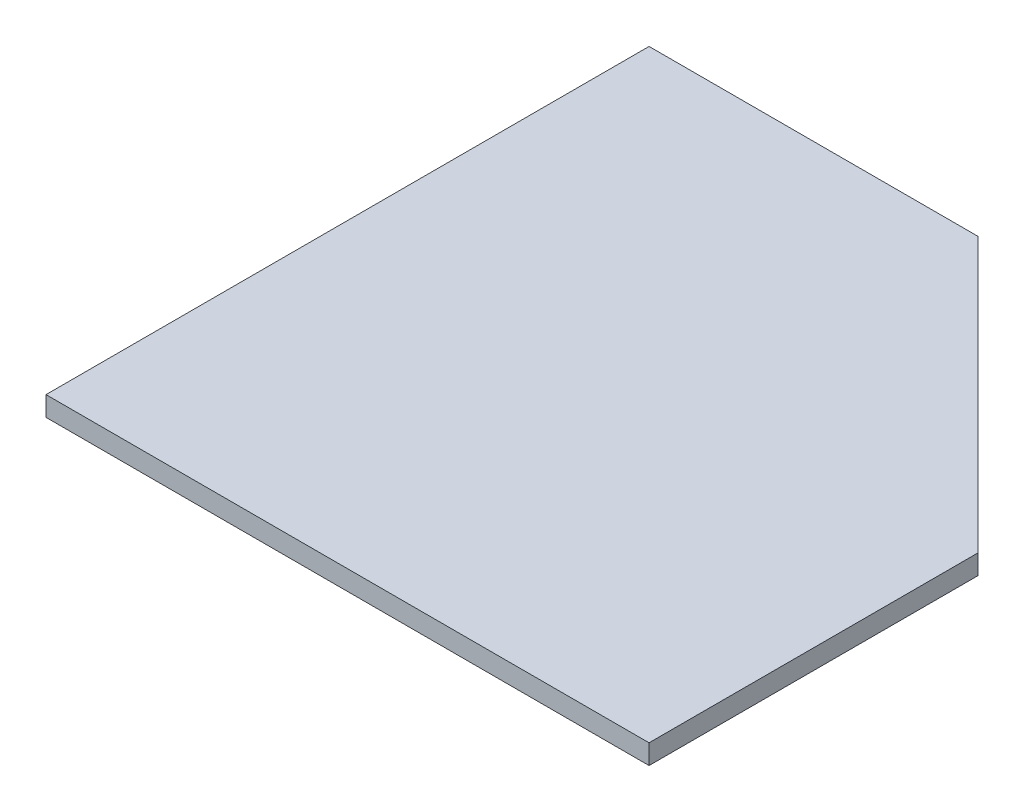
ISO-10303-21;
HEADER;
FILE_DESCRIPTION(('STEP AP214'),'2;1');
FILE_NAME('part.step','',(''),(''),'','','');
FILE_SCHEMA(('AUTOMOTIVE_DESIGN { 1 0 10303 214 1 1 1 1 }'));
ENDSEC;
DATA;
#1=APPLICATION_CONTEXT('core data for automotive mechanical design processes');
#2=APPLICATION_PROTOCOL_DEFINITION('international standard','automotive_design',2000,#1);
#3=PRODUCT_CONTEXT('',#1,'mechanical');
#4=PRODUCT('Part','Part','',(#3));
#5=PRODUCT_RELATED_PRODUCT_CATEGORY('part','',(#4));
#6=PRODUCT_DEFINITION_FORMATION('','',#4);
#7=PRODUCT_DEFINITION_CONTEXT('part definition',#1,'design');
#8=PRODUCT_DEFINITION('design','',#6,#7);
#9=PRODUCT_DEFINITION_SHAPE('','',#8);
#10=(LENGTH_UNIT() NAMED_UNIT(*) SI_UNIT(.MILLI.,.METRE.));
#11=(NAMED_UNIT(*) PLANE_ANGLE_UNIT() SI_UNIT($,.RADIAN.));
#12=(NAMED_UNIT(*) SI_UNIT($,.STERADIAN.) SOLID_ANGLE_UNIT());
#13=UNCERTAINTY_MEASURE_WITH_UNIT(LENGTH_MEASURE(1.E-05),#10,'distance_accuracy_value','');
#14=(GEOMETRIC_REPRESENTATION_CONTEXT(3) GLOBAL_UNCERTAINTY_ASSIGNED_CONTEXT((#13)) GLOBAL_UNIT_ASSIGNED_CONTEXT((#10,
#11,#12)) REPRESENTATION_CONTEXT('',''));
#15=CARTESIAN_POINT('',(0.,0.,0.));
#16=DIRECTION('',(0.,0.,1.));
#17=DIRECTION('',(1.,0.,0.));
#18=AXIS2_PLACEMENT_3D('',#15,#16,#17);
#19=CARTESIAN_POINT('',(550.,18.,0.));
#20=DIRECTION('',(0.,0.,-1.));
#21=DIRECTION('',(-1.,0.,0.));
#22=AXIS2_PLACEMENT_3D('',#19,#20,#21);
#23=PLANE('',#22);
#24=DIRECTION('',(1.,0.,0.));
#25=VECTOR('',#24,1.);
#26=CARTESIAN_POINT('',(550.,0.,0.));
#27=LINE('',#26,#25);
#28=CARTESIAN_POINT('',(0.,0.,0.));
#29=VERTEX_POINT('',#28);
#30=CARTESIAN_POINT('',(550.,0.,0.));
#31=VERTEX_POINT('',#30);
#32=EDGE_CURVE('E108',#29,#31,#27,.T.);
#33=ORIENTED_EDGE('',*,*,#32,.T.);
#34=DIRECTION('',(0.,-1.,0.));
#35=VECTOR('',#34,1.);
#36=CARTESIAN_POINT('',(550.,18.,0.));
#37=LINE('',#36,#35);
#38=CARTESIAN_POINT('',(550.,18.,0.));
#39=VERTEX_POINT('',#38);
#40=EDGE_CURVE('E11',#39,#31,#37,.T.);
#41=ORIENTED_EDGE('',*,*,#40,.F.);
#42=DIRECTION('',(1.,0.,0.));
#43=VECTOR('',#42,1.);
#44=CARTESIAN_POINT('',(550.,18.,0.));
#45=LINE('',#44,#43);
#46=CARTESIAN_POINT('',(0.,18.,0.));
#47=VERTEX_POINT('',#46);
#48=EDGE_CURVE('E116',#47,#39,#45,.T.);
#49=ORIENTED_EDGE('',*,*,#48,.F.);
#50=DIRECTION('',(0.,-1.,0.));
#51=VECTOR('',#50,1.);
#52=CARTESIAN_POINT('',(0.,18.,0.));
#53=LINE('',#52,#51);
#54=EDGE_CURVE('E104',#47,#29,#53,.T.);
#55=ORIENTED_EDGE('',*,*,#54,.T.);
#56=EDGE_LOOP('',(#33,#41,#49,#55));
#57=FACE_BOUND('',#56,.T.);
#58=ADVANCED_FACE('F34',(#57),#23,.F.);
#59=CARTESIAN_POINT('',(550.,18.,-300.));
#60=DIRECTION('',(-1.,0.,0.));
#61=DIRECTION('',(0.,0.,1.));
#62=AXIS2_PLACEMENT_3D('',#59,#60,#61);
#63=PLANE('',#62);
#64=DIRECTION('',(0.,0.,-1.));
#65=VECTOR('',#64,1.);
#66=CARTESIAN_POINT('',(550.,0.,-300.));
#67=LINE('',#66,#65);
#68=CARTESIAN_POINT('',(550.,0.,-300.));
#69=VERTEX_POINT('',#68);
#70=EDGE_CURVE('E111',#31,#69,#67,.T.);
#71=ORIENTED_EDGE('',*,*,#70,.T.);
#72=DIRECTION('',(0.,-1.,0.));
#73=VECTOR('',#72,1.);
#74=CARTESIAN_POINT('',(550.,18.,-300.));
#75=LINE('',#74,#73);
#76=CARTESIAN_POINT('',(550.,18.,-300.));
#77=VERTEX_POINT('',#76);
#78=EDGE_CURVE('E42',#77,#69,#75,.T.);
#79=ORIENTED_EDGE('',*,*,#78,.F.);
#80=DIRECTION('',(0.,0.,-1.));
#81=VECTOR('',#80,1.);
#82=CARTESIAN_POINT('',(550.,18.,-300.));
#83=LINE('',#82,#81);
#84=EDGE_CURVE('E84',#39,#77,#83,.T.);
#85=ORIENTED_EDGE('',*,*,#84,.F.);
#86=ORIENTED_EDGE('',*,*,#40,.T.);
#87=EDGE_LOOP('',(#71,#79,#85,#86));
#88=FACE_BOUND('',#87,.T.);
#89=ADVANCED_FACE('F135',(#88),#63,.F.);
#90=CARTESIAN_POINT('',(300.,18.,-550.));
#91=DIRECTION('',(-0.707106781186548,0.,0.707106781186547));
#92=DIRECTION('',(0.707106781186547,0.,0.707106781186548));
#93=AXIS2_PLACEMENT_3D('',#90,#91,#92);
#94=PLANE('',#93);
#95=DIRECTION('',(-0.707106781186547,0.,-0.707106781186548));
#96=VECTOR('',#95,1.);
#97=CARTESIAN_POINT('',(300.,0.,-550.));
#98=LINE('',#97,#96);
#99=CARTESIAN_POINT('',(300.,0.,-550.));
#100=VERTEX_POINT('',#99);
#101=EDGE_CURVE('E99',#69,#100,#98,.T.);
#102=ORIENTED_EDGE('',*,*,#101,.T.);
#103=DIRECTION('',(0.,-1.,0.));
#104=VECTOR('',#103,1.);
#105=CARTESIAN_POINT('',(300.,18.,-550.));
#106=LINE('',#105,#104);
#107=CARTESIAN_POINT('',(300.,18.,-550.));
#108=VERTEX_POINT('',#107);
#109=EDGE_CURVE('E96',#108,#100,#106,.T.);
#110=ORIENTED_EDGE('',*,*,#109,.F.);
#111=DIRECTION('',(-0.707106781186547,0.,-0.707106781186548));
#112=VECTOR('',#111,1.);
#113=CARTESIAN_POINT('',(300.,18.,-550.));
#114=LINE('',#113,#112);
#115=EDGE_CURVE('E88',#77,#108,#114,.T.);
#116=ORIENTED_EDGE('',*,*,#115,.F.);
#117=ORIENTED_EDGE('',*,*,#78,.T.);
#118=EDGE_LOOP('',(#102,#110,#116,#117));
#119=FACE_BOUND('',#118,.T.);
#120=ADVANCED_FACE('F97',(#119),#94,.F.);
#121=CARTESIAN_POINT('',(0.,18.,-550.));
#122=DIRECTION('',(0.,0.,1.));
#123=DIRECTION('',(1.,0.,0.));
#124=AXIS2_PLACEMENT_3D('',#121,#122,#123);
#125=PLANE('',#124);
#126=DIRECTION('',(-1.,0.,0.));
#127=VECTOR('',#126,1.);
#128=CARTESIAN_POINT('',(0.,0.,-550.));
#129=LINE('',#128,#127);
#130=CARTESIAN_POINT('',(0.,0.,-550.));
#131=VERTEX_POINT('',#130);
#132=EDGE_CURVE('E70',#100,#131,#129,.T.);
#133=ORIENTED_EDGE('',*,*,#132,.T.);
#134=DIRECTION('',(0.,-1.,0.));
#135=VECTOR('',#134,1.);
#136=CARTESIAN_POINT('',(0.,18.,-550.));
#137=LINE('',#136,#135);
#138=CARTESIAN_POINT('',(0.,18.,-550.));
#139=VERTEX_POINT('',#138);
#140=EDGE_CURVE('E100',#139,#131,#137,.T.);
#141=ORIENTED_EDGE('',*,*,#140,.F.);
#142=DIRECTION('',(-1.,0.,0.));
#143=VECTOR('',#142,1.);
#144=CARTESIAN_POINT('',(0.,18.,-550.));
#145=LINE('',#144,#143);
#146=EDGE_CURVE('E92',#108,#139,#145,.T.);
#147=ORIENTED_EDGE('',*,*,#146,.F.);
#148=ORIENTED_EDGE('',*,*,#109,.T.);
#149=EDGE_LOOP('',(#133,#141,#147,#148));
#150=FACE_BOUND('',#149,.T.);
#151=ADVANCED_FACE('F102',(#150),#125,.F.);
#152=CARTESIAN_POINT('',(0.,18.,0.));
#153=DIRECTION('',(1.,0.,0.));
#154=DIRECTION('',(0.,0.,-1.));
#155=AXIS2_PLACEMENT_3D('',#152,#153,#154);
#156=PLANE('',#155);
#157=DIRECTION('',(0.,0.,1.));
#158=VECTOR('',#157,1.);
#159=CARTESIAN_POINT('',(0.,0.,0.));
#160=LINE('',#159,#158);
#161=EDGE_CURVE('E76',#131,#29,#160,.T.);
#162=ORIENTED_EDGE('',*,*,#161,.T.);
#163=ORIENTED_EDGE('',*,*,#54,.F.);
#164=DIRECTION('',(0.,0.,1.));
#165=VECTOR('',#164,1.);
#166=CARTESIAN_POINT('',(0.,18.,0.));
#167=LINE('',#166,#165);
#168=EDGE_CURVE('E50',#139,#47,#167,.T.);
#169=ORIENTED_EDGE('',*,*,#168,.F.);
#170=ORIENTED_EDGE('',*,*,#140,.T.);
#171=EDGE_LOOP('',(#162,#163,#169,#170));
#172=FACE_BOUND('',#171,.T.);
#173=ADVANCED_FACE('F124',(#172),#156,.F.);
#174=CARTESIAN_POINT('',(0.,18.,0.));
#175=DIRECTION('',(0.,-1.,0.));
#176=DIRECTION('',(0.,0.,-1.));
#177=AXIS2_PLACEMENT_3D('',#174,#175,#176);
#178=PLANE('',#177);
#179=ORIENTED_EDGE('',*,*,#48,.T.);
#180=ORIENTED_EDGE('',*,*,#84,.T.);
#181=ORIENTED_EDGE('',*,*,#115,.T.);
#182=ORIENTED_EDGE('',*,*,#146,.T.);
#183=ORIENTED_EDGE('',*,*,#168,.T.);
#184=EDGE_LOOP('',(#179,#180,#181,#182,#183));
#185=FACE_BOUND('',#184,.T.);
#186=ADVANCED_FACE('F90',(#185),#178,.F.);
#187=CARTESIAN_POINT('',(0.,0.,0.));
#188=DIRECTION('',(0.,-1.,0.));
#189=DIRECTION('',(0.,0.,-1.));
#190=AXIS2_PLACEMENT_3D('',#187,#188,#189);
#191=PLANE('',#190);
#192=ORIENTED_EDGE('',*,*,#32,.F.);
#193=ORIENTED_EDGE('',*,*,#161,.F.);
#194=ORIENTED_EDGE('',*,*,#132,.F.);
#195=ORIENTED_EDGE('',*,*,#101,.F.);
#196=ORIENTED_EDGE('',*,*,#70,.F.);
#197=EDGE_LOOP('',(#192,#193,#194,#195,#196));
#198=FACE_BOUND('',#197,.T.);
#199=ADVANCED_FACE('F120',(#198),#191,.T.);
#200=CLOSED_SHELL('',(#58,#89,#120,#151,#173,#186,#199));
#201=MANIFOLD_SOLID_BREP('B2',#200);
#202=ADVANCED_BREP_SHAPE_REPRESENTATION('',(#18,#201),#14);
#203=SHAPE_DEFINITION_REPRESENTATION(#9,#202);
ENDSEC;
END-ISO-10303-21;
